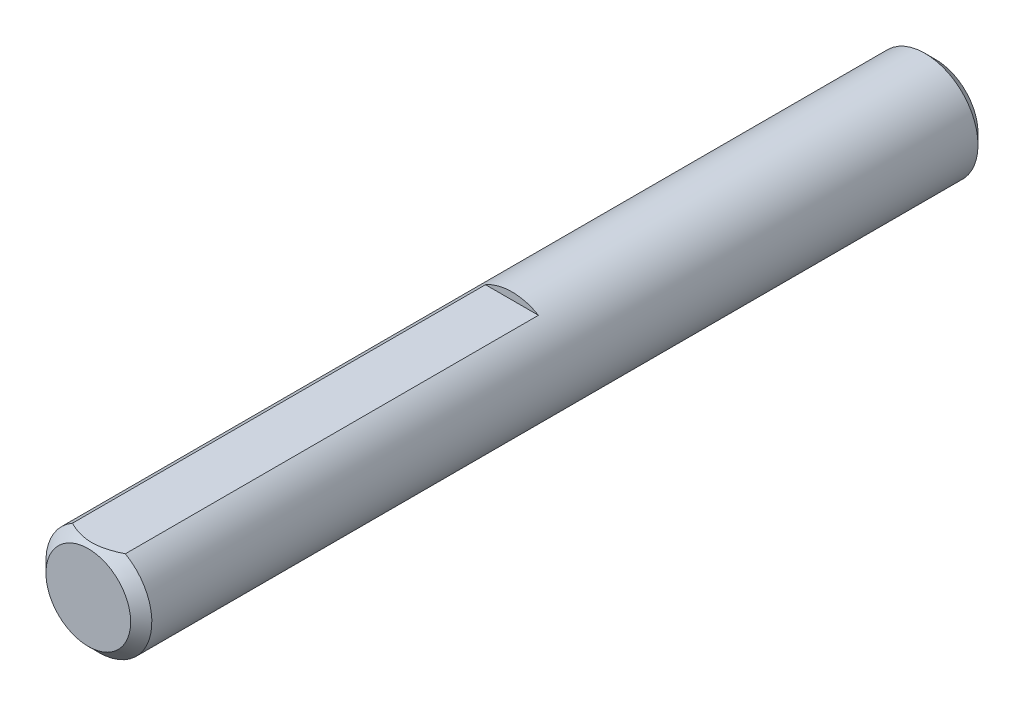
ISO-10303-21;
HEADER;
FILE_DESCRIPTION(('STEP AP214'),'2;1');
FILE_NAME('part.step','',(''),(''),'','','');
FILE_SCHEMA(('AUTOMOTIVE_DESIGN { 1 0 10303 214 1 1 1 1 }'));
ENDSEC;
DATA;
#1=APPLICATION_CONTEXT('core data for automotive mechanical design processes');
#2=APPLICATION_PROTOCOL_DEFINITION('international standard','automotive_design',2000,#1);
#3=PRODUCT_CONTEXT('',#1,'mechanical');
#4=PRODUCT('Part','Part','',(#3));
#5=PRODUCT_RELATED_PRODUCT_CATEGORY('part','',(#4));
#6=PRODUCT_DEFINITION_FORMATION('','',#4);
#7=PRODUCT_DEFINITION_CONTEXT('part definition',#1,'design');
#8=PRODUCT_DEFINITION('design','',#6,#7);
#9=PRODUCT_DEFINITION_SHAPE('','',#8);
#10=(LENGTH_UNIT() NAMED_UNIT(*) SI_UNIT(.MILLI.,.METRE.));
#11=(NAMED_UNIT(*) PLANE_ANGLE_UNIT() SI_UNIT($,.RADIAN.));
#12=(NAMED_UNIT(*) SI_UNIT($,.STERADIAN.) SOLID_ANGLE_UNIT());
#13=UNCERTAINTY_MEASURE_WITH_UNIT(LENGTH_MEASURE(1.E-05),#10,'distance_accuracy_value','');
#14=(GEOMETRIC_REPRESENTATION_CONTEXT(3) GLOBAL_UNCERTAINTY_ASSIGNED_CONTEXT((#13)) GLOBAL_UNIT_ASSIGNED_CONTEXT((#10,
#11,#12)) REPRESENTATION_CONTEXT('',''));
#15=CARTESIAN_POINT('',(0.,0.,0.));
#16=DIRECTION('',(0.,0.,1.));
#17=DIRECTION('',(1.,0.,0.));
#18=AXIS2_PLACEMENT_3D('',#15,#16,#17);
#19=CARTESIAN_POINT('',(0.,0.,25.4));
#20=DIRECTION('',(0.,0.,-1.));
#21=DIRECTION('',(-1.,0.,0.));
#22=AXIS2_PLACEMENT_3D('',#19,#20,#21);
#23=CYLINDRICAL_SURFACE('',#22,3.175);
#24=CARTESIAN_POINT('',(0.,0.,-24.765));
#25=DIRECTION('',(0.,0.,1.));
#26=DIRECTION('',(1.,0.,0.));
#27=AXIS2_PLACEMENT_3D('',#24,#25,#26);
#28=CIRCLE('',#27,3.175);
#29=CARTESIAN_POINT('',(3.175,0.,-24.765));
#30=VERTEX_POINT('',#29);
#31=EDGE_CURVE('E78',#30,#30,#28,.T.);
#32=ORIENTED_EDGE('',*,*,#31,.T.);
#33=EDGE_LOOP('',(#32));
#34=FACE_BOUND('',#33,.T.);
#35=DIRECTION('',(0.,0.,-1.));
#36=VECTOR('',#35,1.);
#37=CARTESIAN_POINT('',(1.5875,2.74963065701559,25.4));
#38=LINE('',#37,#36);
#39=CARTESIAN_POINT('',(1.5875,2.74963065701559,24.765));
#40=VERTEX_POINT('',#39);
#41=CARTESIAN_POINT('',(1.5875,2.74963065701559,0.));
#42=VERTEX_POINT('',#41);
#43=EDGE_CURVE('E66',#40,#42,#38,.T.);
#44=ORIENTED_EDGE('',*,*,#43,.F.);
#45=CARTESIAN_POINT('',(0.,0.,24.765));
#46=DIRECTION('',(0.,0.,1.));
#47=DIRECTION('',(1.,0.,0.));
#48=AXIS2_PLACEMENT_3D('',#45,#46,#47);
#49=CIRCLE('',#48,3.175);
#50=CARTESIAN_POINT('',(-1.5875,2.74963065701559,24.765));
#51=VERTEX_POINT('',#50);
#52=EDGE_CURVE('E76',#40,#51,#49,.F.);
#53=ORIENTED_EDGE('',*,*,#52,.T.);
#54=DIRECTION('',(0.,0.,-1.));
#55=VECTOR('',#54,1.);
#56=CARTESIAN_POINT('',(-1.5875,2.74963065701559,25.4));
#57=LINE('',#56,#55);
#58=CARTESIAN_POINT('',(-1.5875,2.74963065701559,0.));
#59=VERTEX_POINT('',#58);
#60=EDGE_CURVE('E55',#51,#59,#57,.T.);
#61=ORIENTED_EDGE('',*,*,#60,.T.);
#62=CARTESIAN_POINT('',(0.,0.,0.));
#63=DIRECTION('',(0.,0.,1.));
#64=DIRECTION('',(1.,0.,0.));
#65=AXIS2_PLACEMENT_3D('',#62,#63,#64);
#66=CIRCLE('',#65,3.175);
#67=EDGE_CURVE('E69',#42,#59,#66,.T.);
#68=ORIENTED_EDGE('',*,*,#67,.F.);
#69=EDGE_LOOP('',(#44,#53,#61,#68));
#70=FACE_BOUND('',#69,.T.);
#71=ADVANCED_FACE('F34',(#34,#70),#23,.T.);
#72=CARTESIAN_POINT('',(0.,0.,25.4));
#73=DIRECTION('',(0.,0.,-1.));
#74=DIRECTION('',(-1.,0.,0.));
#75=AXIS2_PLACEMENT_3D('',#72,#73,#74);
#76=CONICAL_SURFACE('',#75,2.53999999999999,0.785398163397451);
#77=CARTESIAN_POINT('',(0.,0.,25.4));
#78=DIRECTION('',(0.,0.,1.));
#79=DIRECTION('',(1.,0.,0.));
#80=AXIS2_PLACEMENT_3D('',#77,#78,#79);
#81=CIRCLE('',#80,2.53999999999999);
#82=CARTESIAN_POINT('',(2.53999999999999,0.,25.4));
#83=VERTEX_POINT('',#82);
#84=EDGE_CURVE('E48',#83,#83,#81,.T.);
#85=ORIENTED_EDGE('',*,*,#84,.F.);
#86=EDGE_LOOP('',(#85));
#87=FACE_BOUND('',#86,.T.);
#88=ORIENTED_EDGE('',*,*,#52,.F.);
#89=CARTESIAN_POINT('',(-3.2289613522373,2.74963065701559,23.6989317189837));
#90=CARTESIAN_POINT('',(-3.15061649550105,2.74963065701559,23.758566524546));
#91=CARTESIAN_POINT('',(-3.07184009651264,2.74963065701559,23.817643482025));
#92=CARTESIAN_POINT('',(-2.91325130568819,2.74963065701559,23.9344297176183));
#93=CARTESIAN_POINT('',(-2.83343866506295,2.74963065701559,23.9921386575258));
#94=CARTESIAN_POINT('',(-2.67202062852746,2.74963065701559,24.1063475478051));
#95=CARTESIAN_POINT('',(-2.59040613970428,2.74963065701559,24.1628346895372));
#96=CARTESIAN_POINT('',(-2.42580311622163,2.74963065701559,24.2737635143344));
#97=CARTESIAN_POINT('',(-2.34281467809334,2.74963065701559,24.3282053402285));
#98=CARTESIAN_POINT('',(-2.17021447787228,2.74963065701559,24.4377738711656));
#99=CARTESIAN_POINT('',(-2.08050398524192,2.74963065701559,24.4927458353402));
#100=CARTESIAN_POINT('',(-1.89900904678691,2.74963065701559,24.5991469931979));
#101=CARTESIAN_POINT('',(-1.80722487525634,2.74963065701559,24.6505766518349));
#102=CARTESIAN_POINT('',(-1.62153760368929,2.74963065701559,24.7488148050514));
#103=CARTESIAN_POINT('',(-1.52764140922493,2.74963065701559,24.7956362501767));
#104=CARTESIAN_POINT('',(-1.33724706572099,2.74963065701559,24.8836008153407));
#105=CARTESIAN_POINT('',(-1.24075014112707,2.74963065701559,24.9247465535942));
#106=CARTESIAN_POINT('',(-1.05364742760748,2.74963065701559,24.9965564372305));
#107=CARTESIAN_POINT('',(-0.963276425588634,2.74963065701559,25.0278260439732));
#108=CARTESIAN_POINT('',(-0.780303735161098,2.74963065701559,25.0831231873504));
#109=CARTESIAN_POINT('',(-0.687701898779456,2.74963065701559,25.1071502421446));
#110=CARTESIAN_POINT('',(-0.502391431282845,2.74963065701559,25.1462882908411));
#111=CARTESIAN_POINT('',(-0.409716445146749,2.74963065701559,25.1615559547489));
#112=CARTESIAN_POINT('',(-0.22330633068526,2.74963065701559,25.1828688420294));
#113=CARTESIAN_POINT('',(-0.129571403437362,2.74963065701559,25.1889157860141));
#114=CARTESIAN_POINT('',(0.0543357559016835,2.74963065701559,25.1913094852484));
#115=CARTESIAN_POINT('',(0.144503242552373,2.74963065701559,25.1880280862278));
#116=CARTESIAN_POINT('',(0.324095543573417,2.74963065701559,25.1727817719638));
#117=CARTESIAN_POINT('',(0.413520286896871,2.74963065701559,25.1608160354814));
#118=CARTESIAN_POINT('',(0.592496066024077,2.74963065701559,25.1286615235361));
#119=CARTESIAN_POINT('',(0.682021177379022,2.74963065701559,25.1083305801752));
#120=CARTESIAN_POINT('',(0.859103373963829,2.74963065701559,25.060545197954));
#121=CARTESIAN_POINT('',(0.946660601088789,2.74963065701559,25.0330912745012));
#122=CARTESIAN_POINT('',(1.21954622680464,2.74963065701559,24.9371294821897));
#123=CARTESIAN_POINT('',(1.40108594012668,2.74963065701559,24.8578094527363));
#124=CARTESIAN_POINT('',(1.66675889489861,2.74963065701559,24.7255539852257));
#125=CARTESIAN_POINT('',(1.75437488385019,2.74963065701559,24.6791526611238));
#126=CARTESIAN_POINT('',(1.92761951465603,2.74963065701559,24.5827692377677));
#127=CARTESIAN_POINT('',(2.01324850705459,2.74963065701559,24.5327877765756));
#128=CARTESIAN_POINT('',(2.1785518428574,2.74963065701559,24.4325138433061));
#129=CARTESIAN_POINT('',(2.25831097248804,2.74963065701559,24.3823595590396));
#130=CARTESIAN_POINT('',(2.41646118640001,2.74963065701559,24.2799282177625));
#131=CARTESIAN_POINT('',(2.49485216688182,2.74963065701559,24.2276510006805));
#132=CARTESIAN_POINT('',(2.64980987258634,2.74963065701559,24.1217831250554));
#133=CARTESIAN_POINT('',(2.72638621983964,2.74963065701559,24.0682064917738));
#134=CARTESIAN_POINT('',(2.87849044969172,2.74963065701559,23.9596270900169));
#135=CARTESIAN_POINT('',(2.95401861519267,2.74963065701559,23.904624718309));
#136=CARTESIAN_POINT('',(3.02910770969629,2.74963065701559,23.8490389555825));
#137=B_SPLINE_CURVE_WITH_KNOTS('',3,(#89,#90,#91,#92,#93,#94,#95,#96,#97,#98,#99,#100,#101,#102,
#103,#104,#105,#106,#107,#108,#109,#110,#111,#112,#113,#114,#115,#116,#117,#118,#119,#120,#121,
#122,#123,#124,#125,#126,#127,#128,#129,#130,#131,#132,#133,#134,#135,#136),.UNSPECIFIED.,.F.,
.F.,(4,2,2,2,2,2,2,2,2,2,2,2,2,2,2,2,2,2,2,2,2,2,2,4),(0.,0.295383449271205,0.590839178498787,
0.888580871622951,1.1863017339907,1.50187785569756,1.81741247644346,2.13203338294821,
2.44650866534175,2.73314264689634,3.01979569373832,3.30114758261624,3.58244696402025,
3.85269226293493,4.12296312107187,4.39803055604397,4.67307809311871,5.26557071241312,
5.56297998480381,5.86033638333468,6.1429552359088,6.42559543796927,6.70595195130121,
6.98623126477268),.UNSPECIFIED.);
#138=EDGE_CURVE('E11',#40,#51,#137,.F.);
#139=ORIENTED_EDGE('',*,*,#138,.T.);
#140=EDGE_LOOP('',(#88,#139));
#141=FACE_BOUND('',#140,.T.);
#142=ADVANCED_FACE('F36',(#87,#141),#76,.T.);
#143=CARTESIAN_POINT('',(0.,0.,25.4));
#144=DIRECTION('',(0.,0.,1.));
#145=DIRECTION('',(1.,0.,0.));
#146=AXIS2_PLACEMENT_3D('',#143,#144,#145);
#147=PLANE('',#146);
#148=ORIENTED_EDGE('',*,*,#84,.T.);
#149=EDGE_LOOP('',(#148));
#150=FACE_BOUND('',#149,.T.);
#151=ADVANCED_FACE('F89',(#150),#147,.T.);
#152=CARTESIAN_POINT('',(0.,0.,-25.4));
#153=DIRECTION('',(0.,0.,1.));
#154=DIRECTION('',(1.,0.,0.));
#155=AXIS2_PLACEMENT_3D('',#152,#153,#154);
#156=PLANE('',#155);
#157=CARTESIAN_POINT('',(0.,0.,-25.4));
#158=DIRECTION('',(0.,0.,1.));
#159=DIRECTION('',(1.,0.,0.));
#160=AXIS2_PLACEMENT_3D('',#157,#158,#159);
#161=CIRCLE('',#160,2.54);
#162=CARTESIAN_POINT('',(2.54,0.,-25.4));
#163=VERTEX_POINT('',#162);
#164=EDGE_CURVE('E84',#163,#163,#161,.F.);
#165=ORIENTED_EDGE('',*,*,#164,.T.);
#166=EDGE_LOOP('',(#165));
#167=FACE_BOUND('',#166,.T.);
#168=ADVANCED_FACE('F97',(#167),#156,.F.);
#169=CARTESIAN_POINT('',(0.,0.,-24.765));
#170=DIRECTION('',(0.,0.,1.));
#171=DIRECTION('',(1.,0.,0.));
#172=AXIS2_PLACEMENT_3D('',#169,#170,#171);
#173=CONICAL_SURFACE('',#172,3.175,0.785398163397451);
#174=ORIENTED_EDGE('',*,*,#164,.F.);
#175=EDGE_LOOP('',(#174));
#176=FACE_BOUND('',#175,.T.);
#177=ORIENTED_EDGE('',*,*,#31,.F.);
#178=EDGE_LOOP('',(#177));
#179=FACE_BOUND('',#178,.T.);
#180=ADVANCED_FACE('F104',(#176,#179),#173,.T.);
#181=CARTESIAN_POINT('',(-1.5875,2.74963065701559,25.4));
#182=DIRECTION('',(0.,1.,0.));
#183=DIRECTION('',(0.,0.,1.));
#184=AXIS2_PLACEMENT_3D('',#181,#182,#183);
#185=PLANE('',#184);
#186=ORIENTED_EDGE('',*,*,#43,.T.);
#187=DIRECTION('',(1.,0.,0.));
#188=VECTOR('',#187,1.);
#189=CARTESIAN_POINT('',(-1.5875,2.74963065701559,0.));
#190=LINE('',#189,#188);
#191=EDGE_CURVE('E63',#59,#42,#190,.T.);
#192=ORIENTED_EDGE('',*,*,#191,.F.);
#193=ORIENTED_EDGE('',*,*,#60,.F.);
#194=ORIENTED_EDGE('',*,*,#138,.F.);
#195=EDGE_LOOP('',(#186,#192,#193,#194));
#196=FACE_BOUND('',#195,.T.);
#197=ADVANCED_FACE('F65',(#196),#185,.T.);
#198=CARTESIAN_POINT('',(0.,0.,0.));
#199=DIRECTION('',(0.,0.,1.));
#200=DIRECTION('',(1.,0.,0.));
#201=AXIS2_PLACEMENT_3D('',#198,#199,#200);
#202=PLANE('',#201);
#203=ORIENTED_EDGE('',*,*,#67,.T.);
#204=ORIENTED_EDGE('',*,*,#191,.T.);
#205=EDGE_LOOP('',(#203,#204));
#206=FACE_BOUND('',#205,.T.);
#207=ADVANCED_FACE('F71',(#206),#202,.T.);
#208=CLOSED_SHELL('',(#71,#142,#151,#168,#180,#197,#207));
#209=MANIFOLD_SOLID_BREP('B2',#208);
#210=ADVANCED_BREP_SHAPE_REPRESENTATION('',(#18,#209),#14);
#211=SHAPE_DEFINITION_REPRESENTATION(#9,#210);
ENDSEC;
END-ISO-10303-21;
